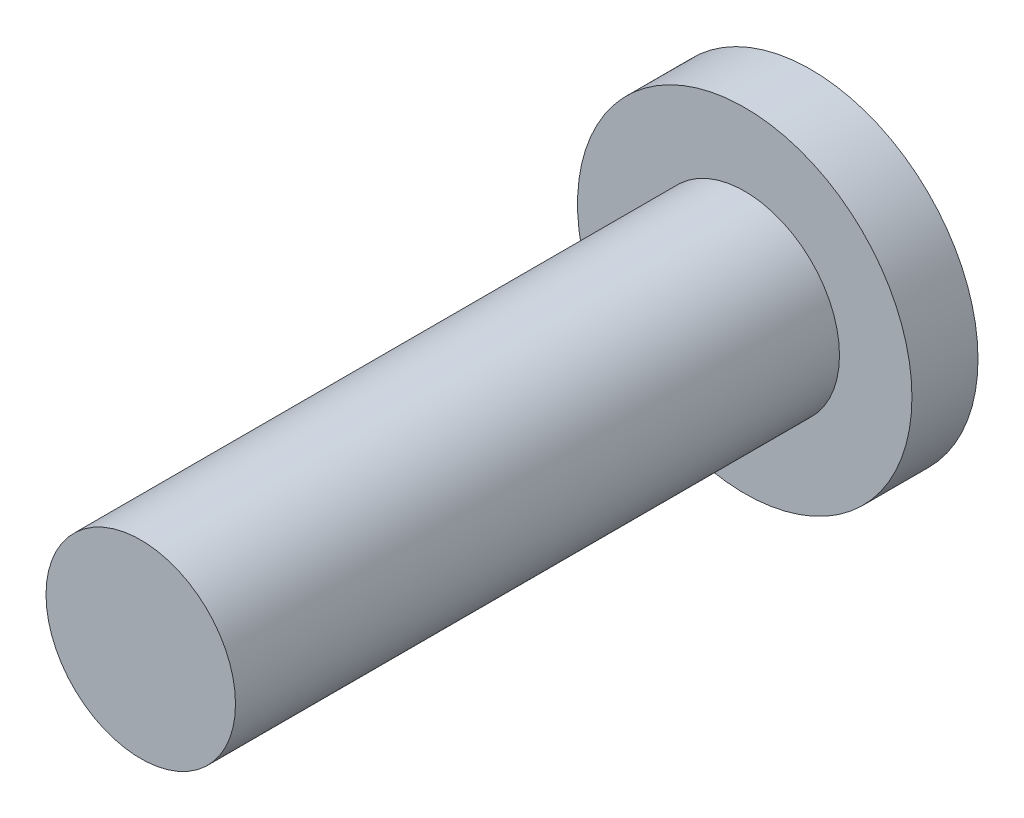
ISO-10303-21;
HEADER;
FILE_DESCRIPTION(('STEP AP214'),'2;1');
FILE_NAME('part.step','',(''),(''),'','','');
FILE_SCHEMA(('AUTOMOTIVE_DESIGN { 1 0 10303 214 1 1 1 1 }'));
ENDSEC;
DATA;
#1=APPLICATION_CONTEXT('core data for automotive mechanical design processes');
#2=APPLICATION_PROTOCOL_DEFINITION('international standard','automotive_design',2000,#1);
#3=PRODUCT_CONTEXT('',#1,'mechanical');
#4=PRODUCT('Part','Part','',(#3));
#5=PRODUCT_RELATED_PRODUCT_CATEGORY('part','',(#4));
#6=PRODUCT_DEFINITION_FORMATION('','',#4);
#7=PRODUCT_DEFINITION_CONTEXT('part definition',#1,'design');
#8=PRODUCT_DEFINITION('design','',#6,#7);
#9=PRODUCT_DEFINITION_SHAPE('','',#8);
#10=(LENGTH_UNIT() NAMED_UNIT(*) SI_UNIT(.MILLI.,.METRE.));
#11=(NAMED_UNIT(*) PLANE_ANGLE_UNIT() SI_UNIT($,.RADIAN.));
#12=(NAMED_UNIT(*) SI_UNIT($,.STERADIAN.) SOLID_ANGLE_UNIT());
#13=UNCERTAINTY_MEASURE_WITH_UNIT(LENGTH_MEASURE(1.E-05),#10,'distance_accuracy_value','');
#14=(GEOMETRIC_REPRESENTATION_CONTEXT(3) GLOBAL_UNCERTAINTY_ASSIGNED_CONTEXT((#13)) GLOBAL_UNIT_ASSIGNED_CONTEXT((#10,
#11,#12)) REPRESENTATION_CONTEXT('',''));
#15=CARTESIAN_POINT('',(0.,0.,0.));
#16=DIRECTION('',(0.,0.,1.));
#17=DIRECTION('',(1.,0.,0.));
#18=AXIS2_PLACEMENT_3D('',#15,#16,#17);
#19=CARTESIAN_POINT('',(-10.060269198017,7.74640728247311,1.778));
#20=DIRECTION('',(0.,0.,-1.));
#21=DIRECTION('',(-1.,0.,0.));
#22=AXIS2_PLACEMENT_3D('',#19,#20,#21);
#23=CYLINDRICAL_SURFACE('',#22,4.5);
#24=CARTESIAN_POINT('',(-10.060269198017,7.74640728247311,1.778));
#25=DIRECTION('',(0.,0.,1.));
#26=DIRECTION('',(1.,0.,0.));
#27=AXIS2_PLACEMENT_3D('',#24,#25,#26);
#28=CIRCLE('',#27,4.5);
#29=CARTESIAN_POINT('',(-5.56026919801701,7.74640728247311,1.778));
#30=VERTEX_POINT('',#29);
#31=EDGE_CURVE('E39',#30,#30,#28,.T.);
#32=ORIENTED_EDGE('',*,*,#31,.F.);
#33=EDGE_LOOP('',(#32));
#34=FACE_BOUND('',#33,.T.);
#35=CARTESIAN_POINT('',(-10.060269198017,7.74640728247311,0.));
#36=DIRECTION('',(0.,0.,1.));
#37=DIRECTION('',(1.,0.,0.));
#38=AXIS2_PLACEMENT_3D('',#35,#36,#37);
#39=CIRCLE('',#38,4.5);
#40=CARTESIAN_POINT('',(-5.56026919801701,7.74640728247311,0.));
#41=VERTEX_POINT('',#40);
#42=EDGE_CURVE('E35',#41,#41,#39,.T.);
#43=ORIENTED_EDGE('',*,*,#42,.T.);
#44=EDGE_LOOP('',(#43));
#45=FACE_BOUND('',#44,.T.);
#46=ADVANCED_FACE('F32',(#34,#45),#23,.T.);
#47=CARTESIAN_POINT('',(-10.060269198017,7.74640728247311,1.778));
#48=DIRECTION('',(0.,0.,1.));
#49=DIRECTION('',(1.,0.,0.));
#50=AXIS2_PLACEMENT_3D('',#47,#48,#49);
#51=PLANE('',#50);
#52=CARTESIAN_POINT('',(-10.060269198017,7.74640728247311,1.778));
#53=DIRECTION('',(0.,0.,1.));
#54=DIRECTION('',(1.,0.,0.));
#55=AXIS2_PLACEMENT_3D('',#52,#53,#54);
#56=CIRCLE('',#55,2.55);
#57=CARTESIAN_POINT('',(-7.51026919801701,7.74640728247311,1.778));
#58=VERTEX_POINT('',#57);
#59=EDGE_CURVE('E10',#58,#58,#56,.T.);
#60=ORIENTED_EDGE('',*,*,#59,.F.);
#61=EDGE_LOOP('',(#60));
#62=FACE_BOUND('',#61,.T.);
#63=ORIENTED_EDGE('',*,*,#31,.T.);
#64=EDGE_LOOP('',(#63));
#65=FACE_BOUND('',#64,.T.);
#66=ADVANCED_FACE('F56',(#62,#65),#51,.T.);
#67=CARTESIAN_POINT('',(-10.060269198017,7.74640728247311,0.));
#68=DIRECTION('',(0.,0.,1.));
#69=DIRECTION('',(1.,0.,0.));
#70=AXIS2_PLACEMENT_3D('',#67,#68,#69);
#71=PLANE('',#70);
#72=ORIENTED_EDGE('',*,*,#42,.F.);
#73=EDGE_LOOP('',(#72));
#74=FACE_BOUND('',#73,.T.);
#75=ADVANCED_FACE('F53',(#74),#71,.F.);
#76=CARTESIAN_POINT('',(-10.060269198017,7.74640728247311,18.034));
#77=DIRECTION('',(0.,0.,-1.));
#78=DIRECTION('',(-1.,0.,0.));
#79=AXIS2_PLACEMENT_3D('',#76,#77,#78);
#80=CYLINDRICAL_SURFACE('',#79,2.55);
#81=CARTESIAN_POINT('',(-10.060269198017,7.74640728247311,18.034));
#82=DIRECTION('',(0.,0.,1.));
#83=DIRECTION('',(1.,0.,0.));
#84=AXIS2_PLACEMENT_3D('',#81,#82,#83);
#85=CIRCLE('',#84,2.55);
#86=CARTESIAN_POINT('',(-7.510269198017,7.74640728247311,18.034));
#87=VERTEX_POINT('',#86);
#88=EDGE_CURVE('E45',#87,#87,#85,.T.);
#89=ORIENTED_EDGE('',*,*,#88,.F.);
#90=EDGE_LOOP('',(#89));
#91=FACE_BOUND('',#90,.T.);
#92=ORIENTED_EDGE('',*,*,#59,.T.);
#93=EDGE_LOOP('',(#92));
#94=FACE_BOUND('',#93,.T.);
#95=ADVANCED_FACE('F55',(#91,#94),#80,.T.);
#96=CARTESIAN_POINT('',(-10.060269198017,7.74640728247311,18.034));
#97=DIRECTION('',(0.,0.,1.));
#98=DIRECTION('',(1.,0.,0.));
#99=AXIS2_PLACEMENT_3D('',#96,#97,#98);
#100=PLANE('',#99);
#101=ORIENTED_EDGE('',*,*,#88,.T.);
#102=EDGE_LOOP('',(#101));
#103=FACE_BOUND('',#102,.T.);
#104=ADVANCED_FACE('F61',(#103),#100,.T.);
#105=CLOSED_SHELL('',(#46,#66,#75,#95,#104));
#106=MANIFOLD_SOLID_BREP('B2',#105);
#107=ADVANCED_BREP_SHAPE_REPRESENTATION('',(#18,#106),#14);
#108=SHAPE_DEFINITION_REPRESENTATION(#9,#107);
ENDSEC;
END-ISO-10303-21;
